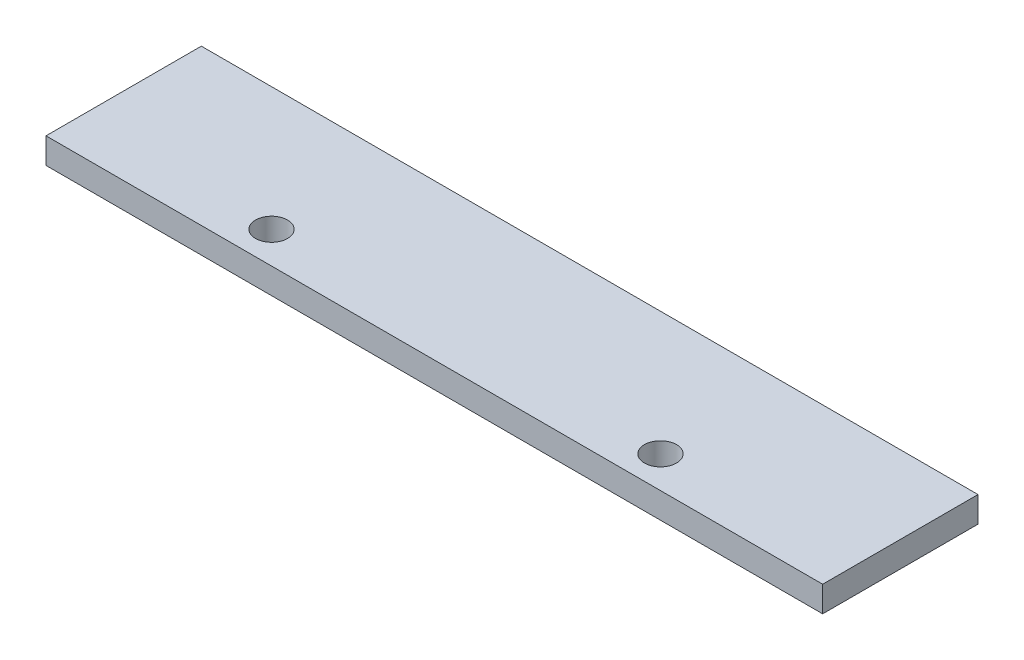
ISO-10303-21;
HEADER;
FILE_DESCRIPTION(('STEP AP214'),'2;1');
FILE_NAME('part.step','',(''),(''),'','','');
FILE_SCHEMA(('AUTOMOTIVE_DESIGN { 1 0 10303 214 1 1 1 1 }'));
ENDSEC;
DATA;
#1=APPLICATION_CONTEXT('core data for automotive mechanical design processes');
#2=APPLICATION_PROTOCOL_DEFINITION('international standard','automotive_design',2000,#1);
#3=PRODUCT_CONTEXT('',#1,'mechanical');
#4=PRODUCT('Part','Part','',(#3));
#5=PRODUCT_RELATED_PRODUCT_CATEGORY('part','',(#4));
#6=PRODUCT_DEFINITION_FORMATION('','',#4);
#7=PRODUCT_DEFINITION_CONTEXT('part definition',#1,'design');
#8=PRODUCT_DEFINITION('design','',#6,#7);
#9=PRODUCT_DEFINITION_SHAPE('','',#8);
#10=(LENGTH_UNIT() NAMED_UNIT(*) SI_UNIT(.MILLI.,.METRE.));
#11=(NAMED_UNIT(*) PLANE_ANGLE_UNIT() SI_UNIT($,.RADIAN.));
#12=(NAMED_UNIT(*) SI_UNIT($,.STERADIAN.) SOLID_ANGLE_UNIT());
#13=UNCERTAINTY_MEASURE_WITH_UNIT(LENGTH_MEASURE(1.E-05),#10,'distance_accuracy_value','');
#14=(GEOMETRIC_REPRESENTATION_CONTEXT(3) GLOBAL_UNCERTAINTY_ASSIGNED_CONTEXT((#13)) GLOBAL_UNIT_ASSIGNED_CONTEXT((#10,
#11,#12)) REPRESENTATION_CONTEXT('',''));
#15=CARTESIAN_POINT('',(0.,0.,0.));
#16=DIRECTION('',(0.,0.,1.));
#17=DIRECTION('',(1.,0.,0.));
#18=AXIS2_PLACEMENT_3D('',#15,#16,#17);
#19=CARTESIAN_POINT('',(25.55,0.845,5.11));
#20=DIRECTION('',(-1.,0.,0.));
#21=DIRECTION('',(0.,0.,1.));
#22=AXIS2_PLACEMENT_3D('',#19,#20,#21);
#23=PLANE('',#22);
#24=DIRECTION('',(0.,0.,-1.));
#25=VECTOR('',#24,1.);
#26=CARTESIAN_POINT('',(25.55,-0.845,5.11));
#27=LINE('',#26,#25);
#28=CARTESIAN_POINT('',(25.55,-0.845,5.11));
#29=VERTEX_POINT('',#28);
#30=CARTESIAN_POINT('',(25.55,-0.845,-5.11));
#31=VERTEX_POINT('',#30);
#32=EDGE_CURVE('E97',#29,#31,#27,.T.);
#33=ORIENTED_EDGE('',*,*,#32,.T.);
#34=DIRECTION('',(0.,-1.,0.));
#35=VECTOR('',#34,1.);
#36=CARTESIAN_POINT('',(25.55,0.845,-5.11));
#37=LINE('',#36,#35);
#38=CARTESIAN_POINT('',(25.55,0.845,-5.11));
#39=VERTEX_POINT('',#38);
#40=EDGE_CURVE('E11',#39,#31,#37,.T.);
#41=ORIENTED_EDGE('',*,*,#40,.F.);
#42=DIRECTION('',(0.,0.,-1.));
#43=VECTOR('',#42,1.);
#44=CARTESIAN_POINT('',(25.55,0.845,5.11));
#45=LINE('',#44,#43);
#46=CARTESIAN_POINT('',(25.55,0.845,5.11));
#47=VERTEX_POINT('',#46);
#48=EDGE_CURVE('E85',#47,#39,#45,.T.);
#49=ORIENTED_EDGE('',*,*,#48,.F.);
#50=DIRECTION('',(0.,-1.,0.));
#51=VECTOR('',#50,1.);
#52=CARTESIAN_POINT('',(25.55,0.845,5.11));
#53=LINE('',#52,#51);
#54=EDGE_CURVE('E93',#47,#29,#53,.T.);
#55=ORIENTED_EDGE('',*,*,#54,.T.);
#56=EDGE_LOOP('',(#33,#41,#49,#55));
#57=FACE_BOUND('',#56,.T.);
#58=ADVANCED_FACE('F34',(#57),#23,.F.);
#59=CARTESIAN_POINT('',(-25.55,0.845,-5.11));
#60=DIRECTION('',(0.,0.,1.));
#61=DIRECTION('',(1.,0.,0.));
#62=AXIS2_PLACEMENT_3D('',#59,#60,#61);
#63=PLANE('',#62);
#64=DIRECTION('',(-1.,0.,0.));
#65=VECTOR('',#64,1.);
#66=CARTESIAN_POINT('',(-25.55,-0.845,-5.11));
#67=LINE('',#66,#65);
#68=CARTESIAN_POINT('',(-25.55,-0.845,-5.11));
#69=VERTEX_POINT('',#68);
#70=EDGE_CURVE('E89',#31,#69,#67,.T.);
#71=ORIENTED_EDGE('',*,*,#70,.T.);
#72=DIRECTION('',(0.,-1.,0.));
#73=VECTOR('',#72,1.);
#74=CARTESIAN_POINT('',(-25.55,0.845,-5.11));
#75=LINE('',#74,#73);
#76=CARTESIAN_POINT('',(-25.55,0.845,-5.11));
#77=VERTEX_POINT('',#76);
#78=EDGE_CURVE('E42',#77,#69,#75,.T.);
#79=ORIENTED_EDGE('',*,*,#78,.F.);
#80=DIRECTION('',(-1.,0.,0.));
#81=VECTOR('',#80,1.);
#82=CARTESIAN_POINT('',(-25.55,0.845,-5.11));
#83=LINE('',#82,#81);
#84=EDGE_CURVE('E80',#39,#77,#83,.T.);
#85=ORIENTED_EDGE('',*,*,#84,.F.);
#86=ORIENTED_EDGE('',*,*,#40,.T.);
#87=EDGE_LOOP('',(#71,#79,#85,#86));
#88=FACE_BOUND('',#87,.T.);
#89=ADVANCED_FACE('F88',(#88),#63,.F.);
#90=CARTESIAN_POINT('',(-25.55,0.845,5.11));
#91=DIRECTION('',(1.,0.,0.));
#92=DIRECTION('',(0.,0.,-1.));
#93=AXIS2_PLACEMENT_3D('',#90,#91,#92);
#94=PLANE('',#93);
#95=DIRECTION('',(0.,0.,1.));
#96=VECTOR('',#95,1.);
#97=CARTESIAN_POINT('',(-25.55,-0.845,5.11));
#98=LINE('',#97,#96);
#99=CARTESIAN_POINT('',(-25.55,-0.845,5.11));
#100=VERTEX_POINT('',#99);
#101=EDGE_CURVE('E67',#69,#100,#98,.T.);
#102=ORIENTED_EDGE('',*,*,#101,.T.);
#103=DIRECTION('',(0.,-1.,0.));
#104=VECTOR('',#103,1.);
#105=CARTESIAN_POINT('',(-25.55,0.845,5.11));
#106=LINE('',#105,#104);
#107=CARTESIAN_POINT('',(-25.55,0.845,5.11));
#108=VERTEX_POINT('',#107);
#109=EDGE_CURVE('E90',#108,#100,#106,.T.);
#110=ORIENTED_EDGE('',*,*,#109,.F.);
#111=DIRECTION('',(0.,0.,1.));
#112=VECTOR('',#111,1.);
#113=CARTESIAN_POINT('',(-25.55,0.845,5.11));
#114=LINE('',#113,#112);
#115=EDGE_CURVE('E83',#77,#108,#114,.T.);
#116=ORIENTED_EDGE('',*,*,#115,.F.);
#117=ORIENTED_EDGE('',*,*,#78,.T.);
#118=EDGE_LOOP('',(#102,#110,#116,#117));
#119=FACE_BOUND('',#118,.T.);
#120=ADVANCED_FACE('F91',(#119),#94,.F.);
#121=CARTESIAN_POINT('',(-25.55,0.845,5.11));
#122=DIRECTION('',(0.,0.,-1.));
#123=DIRECTION('',(-1.,0.,0.));
#124=AXIS2_PLACEMENT_3D('',#121,#122,#123);
#125=PLANE('',#124);
#126=DIRECTION('',(1.,0.,0.));
#127=VECTOR('',#126,1.);
#128=CARTESIAN_POINT('',(-25.55,-0.845,5.11));
#129=LINE('',#128,#127);
#130=EDGE_CURVE('E73',#100,#29,#129,.T.);
#131=ORIENTED_EDGE('',*,*,#130,.T.);
#132=ORIENTED_EDGE('',*,*,#54,.F.);
#133=DIRECTION('',(1.,0.,0.));
#134=VECTOR('',#133,1.);
#135=CARTESIAN_POINT('',(-25.55,0.845,5.11));
#136=LINE('',#135,#134);
#137=EDGE_CURVE('E50',#108,#47,#136,.T.);
#138=ORIENTED_EDGE('',*,*,#137,.F.);
#139=ORIENTED_EDGE('',*,*,#109,.T.);
#140=EDGE_LOOP('',(#131,#132,#138,#139));
#141=FACE_BOUND('',#140,.T.);
#142=ADVANCED_FACE('F105',(#141),#125,.F.);
#143=CARTESIAN_POINT('',(0.,0.845,0.));
#144=DIRECTION('',(0.,-1.,0.));
#145=DIRECTION('',(0.,0.,-1.));
#146=AXIS2_PLACEMENT_3D('',#143,#144,#145);
#147=PLANE('',#146);
#148=CARTESIAN_POINT('',(12.7859935140557,0.845,3.01569041831463));
#149=DIRECTION('',(0.,1.,0.));
#150=DIRECTION('',(0.,0.,1.));
#151=AXIS2_PLACEMENT_3D('',#148,#149,#150);
#152=CIRCLE('',#151,1.05429477609712);
#153=CARTESIAN_POINT('',(12.7859935140557,0.845,4.06998519441175));
#154=VERTEX_POINT('',#153);
#155=EDGE_CURVE('E117',#154,#154,#152,.T.);
#156=ORIENTED_EDGE('',*,*,#155,.F.);
#157=EDGE_LOOP('',(#156));
#158=FACE_BOUND('',#157,.T.);
#159=CARTESIAN_POINT('',(-12.8064961916647,0.845,3.01569041831463));
#160=DIRECTION('',(0.,1.,0.));
#161=DIRECTION('',(0.,0.,1.));
#162=AXIS2_PLACEMENT_3D('',#159,#160,#161);
#163=CIRCLE('',#162,1.05429477609712);
#164=CARTESIAN_POINT('',(-12.8064961916647,0.845,4.06998519441175));
#165=VERTEX_POINT('',#164);
#166=EDGE_CURVE('E111',#165,#165,#163,.T.);
#167=ORIENTED_EDGE('',*,*,#166,.F.);
#168=EDGE_LOOP('',(#167));
#169=FACE_BOUND('',#168,.T.);
#170=ORIENTED_EDGE('',*,*,#48,.T.);
#171=ORIENTED_EDGE('',*,*,#84,.T.);
#172=ORIENTED_EDGE('',*,*,#115,.T.);
#173=ORIENTED_EDGE('',*,*,#137,.T.);
#174=EDGE_LOOP('',(#170,#171,#172,#173));
#175=FACE_BOUND('',#174,.T.);
#176=ADVANCED_FACE('F81',(#158,#169,#175),#147,.F.);
#177=CARTESIAN_POINT('',(0.,-0.845,0.));
#178=DIRECTION('',(0.,-1.,0.));
#179=DIRECTION('',(0.,0.,-1.));
#180=AXIS2_PLACEMENT_3D('',#177,#178,#179);
#181=PLANE('',#180);
#182=CARTESIAN_POINT('',(12.7859935140557,-0.845,3.01569041831463));
#183=DIRECTION('',(0.,1.,0.));
#184=DIRECTION('',(0.,0.,1.));
#185=AXIS2_PLACEMENT_3D('',#182,#183,#184);
#186=CIRCLE('',#185,1.05429477609712);
#187=CARTESIAN_POINT('',(12.7859935140557,-0.845,4.06998519441175));
#188=VERTEX_POINT('',#187);
#189=EDGE_CURVE('E114',#188,#188,#186,.T.);
#190=ORIENTED_EDGE('',*,*,#189,.T.);
#191=EDGE_LOOP('',(#190));
#192=FACE_BOUND('',#191,.T.);
#193=CARTESIAN_POINT('',(-12.8064961916647,-0.845,3.01569041831463));
#194=DIRECTION('',(0.,1.,0.));
#195=DIRECTION('',(0.,0.,1.));
#196=AXIS2_PLACEMENT_3D('',#193,#194,#195);
#197=CIRCLE('',#196,1.05429477609712);
#198=CARTESIAN_POINT('',(-12.8064961916647,-0.845,4.06998519441175));
#199=VERTEX_POINT('',#198);
#200=EDGE_CURVE('E100',#199,#199,#197,.T.);
#201=ORIENTED_EDGE('',*,*,#200,.T.);
#202=EDGE_LOOP('',(#201));
#203=FACE_BOUND('',#202,.T.);
#204=ORIENTED_EDGE('',*,*,#32,.F.);
#205=ORIENTED_EDGE('',*,*,#130,.F.);
#206=ORIENTED_EDGE('',*,*,#101,.F.);
#207=ORIENTED_EDGE('',*,*,#70,.F.);
#208=EDGE_LOOP('',(#204,#205,#206,#207));
#209=FACE_BOUND('',#208,.T.);
#210=ADVANCED_FACE('F108',(#192,#203,#209),#181,.T.);
#211=CARTESIAN_POINT('',(-12.8064961916647,-0.845,3.01569041831463));
#212=DIRECTION('',(0.,1.,0.));
#213=DIRECTION('',(0.,0.,1.));
#214=AXIS2_PLACEMENT_3D('',#211,#212,#213);
#215=CYLINDRICAL_SURFACE('',#214,1.05429477609712);
#216=ORIENTED_EDGE('',*,*,#200,.F.);
#217=EDGE_LOOP('',(#216));
#218=FACE_BOUND('',#217,.T.);
#219=ORIENTED_EDGE('',*,*,#166,.T.);
#220=EDGE_LOOP('',(#219));
#221=FACE_BOUND('',#220,.T.);
#222=ADVANCED_FACE('F128',(#218,#221),#215,.F.);
#223=CARTESIAN_POINT('',(12.7859935140557,-0.845,3.01569041831463));
#224=DIRECTION('',(0.,1.,0.));
#225=DIRECTION('',(0.,0.,1.));
#226=AXIS2_PLACEMENT_3D('',#223,#224,#225);
#227=CYLINDRICAL_SURFACE('',#226,1.05429477609712);
#228=ORIENTED_EDGE('',*,*,#189,.F.);
#229=EDGE_LOOP('',(#228));
#230=FACE_BOUND('',#229,.T.);
#231=ORIENTED_EDGE('',*,*,#155,.T.);
#232=EDGE_LOOP('',(#231));
#233=FACE_BOUND('',#232,.T.);
#234=ADVANCED_FACE('F125',(#230,#233),#227,.F.);
#235=CLOSED_SHELL('',(#58,#89,#120,#142,#176,#210,#222,#234));
#236=MANIFOLD_SOLID_BREP('B2',#235);
#237=ADVANCED_BREP_SHAPE_REPRESENTATION('',(#18,#236),#14);
#238=SHAPE_DEFINITION_REPRESENTATION(#9,#237);
ENDSEC;
END-ISO-10303-21;
